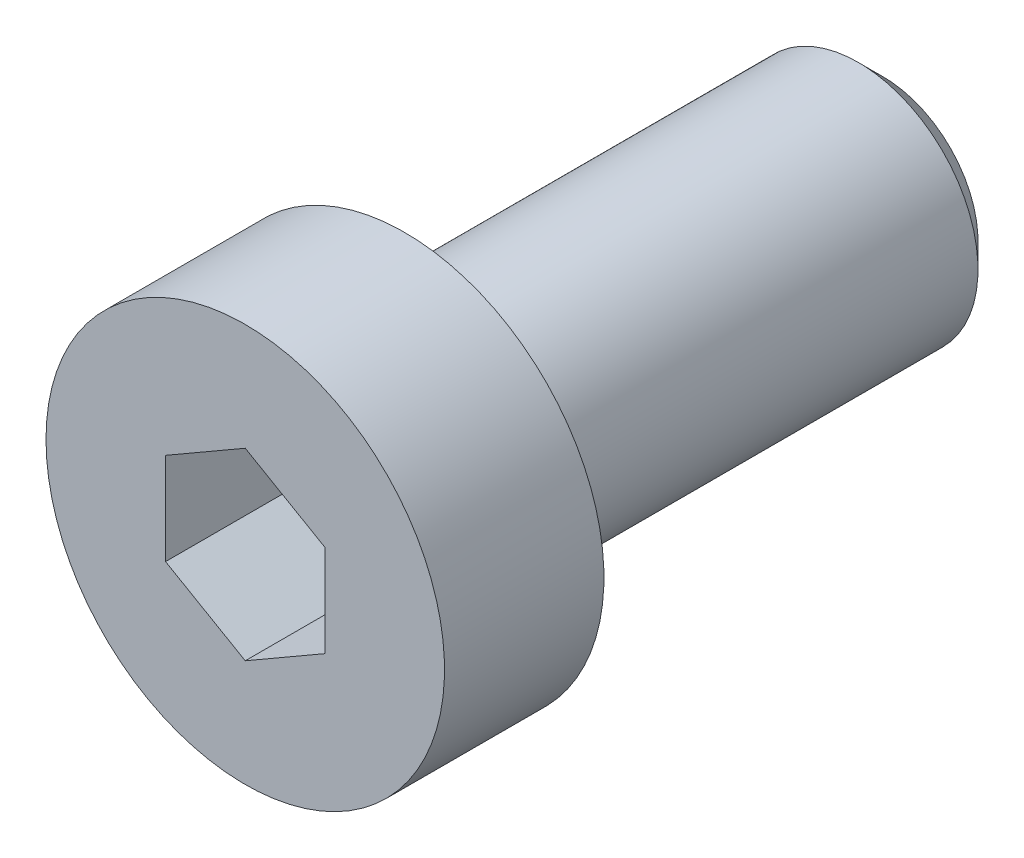
ISO-10303-21;
HEADER;
FILE_DESCRIPTION(('STEP AP214'),'2;1');
FILE_NAME('part.step','',(''),(''),'','','');
FILE_SCHEMA(('AUTOMOTIVE_DESIGN { 1 0 10303 214 1 1 1 1 }'));
ENDSEC;
DATA;
#1=APPLICATION_CONTEXT('core data for automotive mechanical design processes');
#2=APPLICATION_PROTOCOL_DEFINITION('international standard','automotive_design',2000,#1);
#3=PRODUCT_CONTEXT('',#1,'mechanical');
#4=PRODUCT('Part','Part','',(#3));
#5=PRODUCT_RELATED_PRODUCT_CATEGORY('part','',(#4));
#6=PRODUCT_DEFINITION_FORMATION('','',#4);
#7=PRODUCT_DEFINITION_CONTEXT('part definition',#1,'design');
#8=PRODUCT_DEFINITION('design','',#6,#7);
#9=PRODUCT_DEFINITION_SHAPE('','',#8);
#10=(LENGTH_UNIT() NAMED_UNIT(*) SI_UNIT(.MILLI.,.METRE.));
#11=(NAMED_UNIT(*) PLANE_ANGLE_UNIT() SI_UNIT($,.RADIAN.));
#12=(NAMED_UNIT(*) SI_UNIT($,.STERADIAN.) SOLID_ANGLE_UNIT());
#13=UNCERTAINTY_MEASURE_WITH_UNIT(LENGTH_MEASURE(1.E-05),#10,'distance_accuracy_value','');
#14=(GEOMETRIC_REPRESENTATION_CONTEXT(3) GLOBAL_UNCERTAINTY_ASSIGNED_CONTEXT((#13)) GLOBAL_UNIT_ASSIGNED_CONTEXT((#10,
#11,#12)) REPRESENTATION_CONTEXT('',''));
#15=CARTESIAN_POINT('',(0.,0.,0.));
#16=DIRECTION('',(0.,0.,1.));
#17=DIRECTION('',(1.,0.,0.));
#18=AXIS2_PLACEMENT_3D('',#15,#16,#17);
#19=CARTESIAN_POINT('',(0.,0.,-3.4));
#20=DIRECTION('',(0.,0.,1.));
#21=DIRECTION('',(1.,0.,0.));
#22=AXIS2_PLACEMENT_3D('',#19,#20,#21);
#23=PLANE('',#22);
#24=DIRECTION('',(0.,-1.,0.));
#25=VECTOR('',#24,1.);
#26=CARTESIAN_POINT('',(-17.5,22.6547005383793,-3.4));
#27=LINE('',#26,#25);
#28=CARTESIAN_POINT('',(-17.5,22.6547005383793,-3.4));
#29=VERTEX_POINT('',#28);
#30=CARTESIAN_POINT('',(-17.5,21.5,-3.39999999999918));
#31=VERTEX_POINT('',#30);
#32=EDGE_CURVE('E350',#29,#31,#27,.T.);
#33=ORIENTED_EDGE('',*,*,#32,.T.);
#34=CARTESIAN_POINT('',(-15.5,21.5,-3.39999999999918));
#35=DIRECTION('',(0.,0.,-1.));
#36=DIRECTION('',(-1.,0.,0.));
#37=AXIS2_PLACEMENT_3D('',#34,#35,#36);
#38=CIRCLE('',#37,2.00000000000637);
#39=CARTESIAN_POINT('',(-16.5000000000032,23.2320508075744,-3.39999999999918));
#40=VERTEX_POINT('',#39);
#41=EDGE_CURVE('E50',#31,#40,#38,.T.);
#42=ORIENTED_EDGE('',*,*,#41,.T.);
#43=DIRECTION('',(-0.866025403784445,-0.499999999999989,0.));
#44=VECTOR('',#43,1.);
#45=CARTESIAN_POINT('',(-15.5,23.8094010767585,-3.4));
#46=LINE('',#45,#44);
#47=EDGE_CURVE('E337',#40,#29,#46,.T.);
#48=ORIENTED_EDGE('',*,*,#47,.T.);
#49=EDGE_LOOP('',(#33,#42,#48));
#50=FACE_BOUND('',#49,.T.);
#51=ADVANCED_FACE('F35',(#50),#23,.T.);
#52=CARTESIAN_POINT('',(-15.5,23.8094010767585,-3.4));
#53=VERTEX_POINT('',#52);
#54=EDGE_CURVE('E367',#53,#40,#46,.T.);
#55=ORIENTED_EDGE('',*,*,#54,.T.);
#56=CARTESIAN_POINT('',(-14.4999999999968,23.2320508075744,-3.39999999999918));
#57=VERTEX_POINT('',#56);
#58=EDGE_CURVE('E200',#40,#57,#38,.T.);
#59=ORIENTED_EDGE('',*,*,#58,.T.);
#60=DIRECTION('',(-0.866025403784446,0.499999999999988,0.));
#61=VECTOR('',#60,1.);
#62=CARTESIAN_POINT('',(-13.5,22.6547005383793,-3.4));
#63=LINE('',#62,#61);
#64=EDGE_CURVE('E312',#57,#53,#63,.T.);
#65=ORIENTED_EDGE('',*,*,#64,.T.);
#66=EDGE_LOOP('',(#55,#59,#65));
#67=FACE_BOUND('',#66,.T.);
#68=ADVANCED_FACE('F123',(#67),#23,.T.);
#69=CARTESIAN_POINT('',(-13.5,22.6547005383793,-3.4));
#70=VERTEX_POINT('',#69);
#71=EDGE_CURVE('E315',#70,#57,#63,.T.);
#72=ORIENTED_EDGE('',*,*,#71,.T.);
#73=CARTESIAN_POINT('',(-13.4999999999936,21.5,-3.39999999999918));
#74=VERTEX_POINT('',#73);
#75=EDGE_CURVE('E371',#57,#74,#38,.T.);
#76=ORIENTED_EDGE('',*,*,#75,.T.);
#77=DIRECTION('',(0.,1.,0.));
#78=VECTOR('',#77,1.);
#79=CARTESIAN_POINT('',(-13.5,20.3452994616207,-3.4));
#80=LINE('',#79,#78);
#81=EDGE_CURVE('E313',#74,#70,#80,.T.);
#82=ORIENTED_EDGE('',*,*,#81,.T.);
#83=EDGE_LOOP('',(#72,#76,#82));
#84=FACE_BOUND('',#83,.T.);
#85=ADVANCED_FACE('F128',(#84),#23,.T.);
#86=CARTESIAN_POINT('',(-13.5,20.3452994616207,-3.4));
#87=VERTEX_POINT('',#86);
#88=EDGE_CURVE('E306',#87,#74,#80,.T.);
#89=ORIENTED_EDGE('',*,*,#88,.T.);
#90=CARTESIAN_POINT('',(-14.4999999999968,19.7679491924256,-3.39999999999918));
#91=VERTEX_POINT('',#90);
#92=EDGE_CURVE('E307',#74,#91,#38,.T.);
#93=ORIENTED_EDGE('',*,*,#92,.T.);
#94=DIRECTION('',(0.866025403784444,0.49999999999999,0.));
#95=VECTOR('',#94,1.);
#96=CARTESIAN_POINT('',(-15.5,19.1905989232415,-3.4));
#97=LINE('',#96,#95);
#98=EDGE_CURVE('E309',#91,#87,#97,.T.);
#99=ORIENTED_EDGE('',*,*,#98,.T.);
#100=EDGE_LOOP('',(#89,#93,#99));
#101=FACE_BOUND('',#100,.T.);
#102=ADVANCED_FACE('F176',(#101),#23,.T.);
#103=CARTESIAN_POINT('',(-15.5,19.1905989232415,-3.4));
#104=VERTEX_POINT('',#103);
#105=EDGE_CURVE('E317',#104,#91,#97,.T.);
#106=ORIENTED_EDGE('',*,*,#105,.T.);
#107=CARTESIAN_POINT('',(-16.5000000000032,19.7679491924256,-3.39999999999918));
#108=VERTEX_POINT('',#107);
#109=EDGE_CURVE('E372',#91,#108,#38,.T.);
#110=ORIENTED_EDGE('',*,*,#109,.T.);
#111=DIRECTION('',(0.866025403784446,-0.499999999999987,0.));
#112=VECTOR('',#111,1.);
#113=CARTESIAN_POINT('',(-17.5,20.3452994616207,-3.4));
#114=LINE('',#113,#112);
#115=EDGE_CURVE('E359',#108,#104,#114,.T.);
#116=ORIENTED_EDGE('',*,*,#115,.T.);
#117=EDGE_LOOP('',(#106,#110,#116));
#118=FACE_BOUND('',#117,.T.);
#119=ADVANCED_FACE('F121',(#118),#23,.T.);
#120=CARTESIAN_POINT('',(-15.5,21.5,-0.4));
#121=DIRECTION('',(0.,0.,-1.));
#122=DIRECTION('',(-1.,0.,0.));
#123=AXIS2_PLACEMENT_3D('',#120,#121,#122);
#124=CYLINDRICAL_SURFACE('',#123,5.);
#125=CARTESIAN_POINT('',(-15.5,21.5,-0.4));
#126=DIRECTION('',(0.,0.,-1.));
#127=DIRECTION('',(-1.,0.,0.));
#128=AXIS2_PLACEMENT_3D('',#125,#126,#127);
#129=CIRCLE('',#128,5.);
#130=CARTESIAN_POINT('',(-20.5,21.5,-0.4));
#131=VERTEX_POINT('',#130);
#132=EDGE_CURVE('E181',#131,#131,#129,.T.);
#133=ORIENTED_EDGE('',*,*,#132,.T.);
#134=EDGE_LOOP('',(#133));
#135=FACE_BOUND('',#134,.T.);
#136=CARTESIAN_POINT('',(-15.5,21.5,-4.4));
#137=DIRECTION('',(0.,0.,-1.));
#138=DIRECTION('',(-1.,0.,0.));
#139=AXIS2_PLACEMENT_3D('',#136,#137,#138);
#140=CIRCLE('',#139,5.);
#141=CARTESIAN_POINT('',(-20.5,21.5,-4.4));
#142=VERTEX_POINT('',#141);
#143=EDGE_CURVE('E184',#142,#142,#140,.T.);
#144=ORIENTED_EDGE('',*,*,#143,.F.);
#145=EDGE_LOOP('',(#144));
#146=FACE_BOUND('',#145,.T.);
#147=ADVANCED_FACE('F169',(#135,#146),#124,.T.);
#148=CARTESIAN_POINT('',(-10.5,21.5,-0.4));
#149=DIRECTION('',(0.,0.,1.));
#150=DIRECTION('',(1.,0.,0.));
#151=AXIS2_PLACEMENT_3D('',#148,#149,#150);
#152=PLANE('',#151);
#153=DIRECTION('',(-0.866025403784445,-0.499999999999989,0.));
#154=VECTOR('',#153,1.);
#155=CARTESIAN_POINT('',(-15.5,23.8094010767585,-0.4));
#156=LINE('',#155,#154);
#157=CARTESIAN_POINT('',(-15.5,23.8094010767585,-0.4));
#158=VERTEX_POINT('',#157);
#159=CARTESIAN_POINT('',(-17.5,22.6547005383793,-0.4));
#160=VERTEX_POINT('',#159);
#161=EDGE_CURVE('E58',#158,#160,#156,.T.);
#162=ORIENTED_EDGE('',*,*,#161,.F.);
#163=DIRECTION('',(-0.866025403784446,0.499999999999988,0.));
#164=VECTOR('',#163,1.);
#165=CARTESIAN_POINT('',(-13.5,22.6547005383793,-0.4));
#166=LINE('',#165,#164);
#167=CARTESIAN_POINT('',(-13.5,22.6547005383793,-0.4));
#168=VERTEX_POINT('',#167);
#169=EDGE_CURVE('E335',#168,#158,#166,.T.);
#170=ORIENTED_EDGE('',*,*,#169,.F.);
#171=DIRECTION('',(0.,1.,0.));
#172=VECTOR('',#171,1.);
#173=CARTESIAN_POINT('',(-13.5,20.3452994616207,-0.4));
#174=LINE('',#173,#172);
#175=CARTESIAN_POINT('',(-13.5,20.3452994616207,-0.4));
#176=VERTEX_POINT('',#175);
#177=EDGE_CURVE('E332',#176,#168,#174,.T.);
#178=ORIENTED_EDGE('',*,*,#177,.F.);
#179=DIRECTION('',(0.866025403784444,0.49999999999999,0.));
#180=VECTOR('',#179,1.);
#181=CARTESIAN_POINT('',(-15.5,19.1905989232415,-0.4));
#182=LINE('',#181,#180);
#183=CARTESIAN_POINT('',(-15.5,19.1905989232415,-0.4));
#184=VERTEX_POINT('',#183);
#185=EDGE_CURVE('E329',#184,#176,#182,.T.);
#186=ORIENTED_EDGE('',*,*,#185,.F.);
#187=DIRECTION('',(0.866025403784446,-0.499999999999987,0.));
#188=VECTOR('',#187,1.);
#189=CARTESIAN_POINT('',(-17.5,20.3452994616207,-0.4));
#190=LINE('',#189,#188);
#191=CARTESIAN_POINT('',(-17.5,20.3452994616207,-0.4));
#192=VERTEX_POINT('',#191);
#193=EDGE_CURVE('E326',#192,#184,#190,.T.);
#194=ORIENTED_EDGE('',*,*,#193,.F.);
#195=DIRECTION('',(0.,-1.,0.));
#196=VECTOR('',#195,1.);
#197=CARTESIAN_POINT('',(-17.5,22.6547005383793,-0.4));
#198=LINE('',#197,#196);
#199=EDGE_CURVE('E323',#160,#192,#198,.T.);
#200=ORIENTED_EDGE('',*,*,#199,.F.);
#201=EDGE_LOOP('',(#162,#170,#178,#186,#194,#200));
#202=FACE_BOUND('',#201,.T.);
#203=ORIENTED_EDGE('',*,*,#132,.F.);
#204=EDGE_LOOP('',(#203));
#205=FACE_BOUND('',#204,.T.);
#206=ADVANCED_FACE('F165',(#202,#205),#152,.T.);
#207=CARTESIAN_POINT('',(-15.5,21.5,-4.4));
#208=DIRECTION('',(0.,0.,-1.));
#209=DIRECTION('',(-1.,0.,0.));
#210=AXIS2_PLACEMENT_3D('',#207,#208,#209);
#211=PLANE('',#210);
#212=CARTESIAN_POINT('',(-15.5,21.5,-4.4));
#213=DIRECTION('',(0.,0.,-1.));
#214=DIRECTION('',(-1.,0.,0.));
#215=AXIS2_PLACEMENT_3D('',#212,#213,#214);
#216=CIRCLE('',#215,3.2);
#217=CARTESIAN_POINT('',(-18.7,21.5,-4.4));
#218=VERTEX_POINT('',#217);
#219=EDGE_CURVE('E11',#218,#218,#216,.F.);
#220=ORIENTED_EDGE('',*,*,#219,.T.);
#221=EDGE_LOOP('',(#220));
#222=FACE_BOUND('',#221,.T.);
#223=ORIENTED_EDGE('',*,*,#143,.T.);
#224=EDGE_LOOP('',(#223));
#225=FACE_BOUND('',#224,.T.);
#226=ADVANCED_FACE('F161',(#222,#225),#211,.T.);
#227=CARTESIAN_POINT('',(-15.5,21.5,-16.4));
#228=DIRECTION('',(0.,0.,1.));
#229=DIRECTION('',(1.,0.,0.));
#230=AXIS2_PLACEMENT_3D('',#227,#228,#229);
#231=CYLINDRICAL_SURFACE('',#230,3.);
#232=CARTESIAN_POINT('',(-15.5,21.5,-4.6));
#233=DIRECTION('',(0.,0.,-1.));
#234=DIRECTION('',(-1.,0.,0.));
#235=AXIS2_PLACEMENT_3D('',#232,#233,#234);
#236=CIRCLE('',#235,3.);
#237=CARTESIAN_POINT('',(-18.5,21.5,-4.6));
#238=VERTEX_POINT('',#237);
#239=EDGE_CURVE('E43',#238,#238,#236,.T.);
#240=ORIENTED_EDGE('',*,*,#239,.T.);
#241=EDGE_LOOP('',(#240));
#242=FACE_BOUND('',#241,.T.);
#243=CARTESIAN_POINT('',(-15.5,21.5,-15.7865000000105));
#244=DIRECTION('',(0.,0.,-1.));
#245=DIRECTION('',(-1.,0.,0.));
#246=AXIS2_PLACEMENT_3D('',#243,#244,#245);
#247=CIRCLE('',#246,3.);
#248=CARTESIAN_POINT('',(-18.5,21.5,-15.7865000000105));
#249=VERTEX_POINT('',#248);
#250=EDGE_CURVE('E199',#249,#249,#247,.F.);
#251=ORIENTED_EDGE('',*,*,#250,.T.);
#252=EDGE_LOOP('',(#251));
#253=FACE_BOUND('',#252,.T.);
#254=ADVANCED_FACE('F157',(#242,#253),#231,.T.);
#255=CARTESIAN_POINT('',(-15.5,21.5,-16.4));
#256=DIRECTION('',(0.,0.,-1.));
#257=DIRECTION('',(-1.,0.,0.));
#258=AXIS2_PLACEMENT_3D('',#255,#256,#257);
#259=PLANE('',#258);
#260=CARTESIAN_POINT('',(-15.5,21.5,-16.4));
#261=DIRECTION('',(0.,0.,-1.));
#262=DIRECTION('',(-1.,0.,0.));
#263=AXIS2_PLACEMENT_3D('',#260,#261,#262);
#264=CIRCLE('',#263,2.38650000001045);
#265=CARTESIAN_POINT('',(-17.8865000000105,21.5,-16.4));
#266=VERTEX_POINT('',#265);
#267=EDGE_CURVE('E196',#266,#266,#264,.T.);
#268=ORIENTED_EDGE('',*,*,#267,.T.);
#269=EDGE_LOOP('',(#268));
#270=FACE_BOUND('',#269,.T.);
#271=ADVANCED_FACE('F154',(#270),#259,.T.);
#272=CARTESIAN_POINT('',(-15.5,23.8094010767585,-3.4));
#273=DIRECTION('',(-0.499999999999989,0.866025403784445,0.));
#274=DIRECTION('',(-0.866025403784445,-0.499999999999989,0.));
#275=AXIS2_PLACEMENT_3D('',#272,#273,#274);
#276=PLANE('',#275);
#277=ORIENTED_EDGE('',*,*,#161,.T.);
#278=DIRECTION('',(0.,0.,1.));
#279=VECTOR('',#278,1.);
#280=CARTESIAN_POINT('',(-17.5,22.6547005383793,-3.4));
#281=LINE('',#280,#279);
#282=EDGE_CURVE('E193',#29,#160,#281,.T.);
#283=ORIENTED_EDGE('',*,*,#282,.F.);
#284=ORIENTED_EDGE('',*,*,#47,.F.);
#285=ORIENTED_EDGE('',*,*,#54,.F.);
#286=DIRECTION('',(0.,0.,1.));
#287=VECTOR('',#286,1.);
#288=CARTESIAN_POINT('',(-15.5,23.8094010767585,-3.4));
#289=LINE('',#288,#287);
#290=EDGE_CURVE('E186',#53,#158,#289,.T.);
#291=ORIENTED_EDGE('',*,*,#290,.T.);
#292=EDGE_LOOP('',(#277,#283,#284,#285,#291));
#293=FACE_BOUND('',#292,.T.);
#294=ADVANCED_FACE('F136',(#293),#276,.F.);
#295=CARTESIAN_POINT('',(-13.5,22.6547005383793,-3.4));
#296=DIRECTION('',(0.499999999999988,0.866025403784446,0.));
#297=DIRECTION('',(-0.866025403784446,0.499999999999988,0.));
#298=AXIS2_PLACEMENT_3D('',#295,#296,#297);
#299=PLANE('',#298);
#300=ORIENTED_EDGE('',*,*,#169,.T.);
#301=ORIENTED_EDGE('',*,*,#290,.F.);
#302=ORIENTED_EDGE('',*,*,#64,.F.);
#303=ORIENTED_EDGE('',*,*,#71,.F.);
#304=DIRECTION('',(0.,0.,1.));
#305=VECTOR('',#304,1.);
#306=CARTESIAN_POINT('',(-13.5,22.6547005383793,-3.4));
#307=LINE('',#306,#305);
#308=EDGE_CURVE('E190',#70,#168,#307,.T.);
#309=ORIENTED_EDGE('',*,*,#308,.T.);
#310=EDGE_LOOP('',(#300,#301,#302,#303,#309));
#311=FACE_BOUND('',#310,.T.);
#312=ADVANCED_FACE('F132',(#311),#299,.F.);
#313=CARTESIAN_POINT('',(-13.5,20.3452994616207,-3.4));
#314=DIRECTION('',(1.,0.,0.));
#315=DIRECTION('',(0.,1.,0.));
#316=AXIS2_PLACEMENT_3D('',#313,#314,#315);
#317=PLANE('',#316);
#318=ORIENTED_EDGE('',*,*,#177,.T.);
#319=ORIENTED_EDGE('',*,*,#308,.F.);
#320=ORIENTED_EDGE('',*,*,#81,.F.);
#321=ORIENTED_EDGE('',*,*,#88,.F.);
#322=DIRECTION('',(0.,0.,1.));
#323=VECTOR('',#322,1.);
#324=CARTESIAN_POINT('',(-13.5,20.3452994616207,-3.4));
#325=LINE('',#324,#323);
#326=EDGE_CURVE('E340',#87,#176,#325,.T.);
#327=ORIENTED_EDGE('',*,*,#326,.T.);
#328=EDGE_LOOP('',(#318,#319,#320,#321,#327));
#329=FACE_BOUND('',#328,.T.);
#330=ADVANCED_FACE('F135',(#329),#317,.F.);
#331=CARTESIAN_POINT('',(-15.5,19.1905989232415,-3.4));
#332=DIRECTION('',(0.49999999999999,-0.866025403784444,0.));
#333=DIRECTION('',(0.866025403784444,0.49999999999999,0.));
#334=AXIS2_PLACEMENT_3D('',#331,#332,#333);
#335=PLANE('',#334);
#336=ORIENTED_EDGE('',*,*,#185,.T.);
#337=ORIENTED_EDGE('',*,*,#326,.F.);
#338=ORIENTED_EDGE('',*,*,#98,.F.);
#339=ORIENTED_EDGE('',*,*,#105,.F.);
#340=DIRECTION('',(0.,0.,1.));
#341=VECTOR('',#340,1.);
#342=CARTESIAN_POINT('',(-15.5,19.1905989232415,-3.4));
#343=LINE('',#342,#341);
#344=EDGE_CURVE('E342',#104,#184,#343,.T.);
#345=ORIENTED_EDGE('',*,*,#344,.T.);
#346=EDGE_LOOP('',(#336,#337,#338,#339,#345));
#347=FACE_BOUND('',#346,.T.);
#348=ADVANCED_FACE('F140',(#347),#335,.F.);
#349=CARTESIAN_POINT('',(-17.5,20.3452994616207,-3.4));
#350=DIRECTION('',(-0.499999999999988,-0.866025403784446,0.));
#351=DIRECTION('',(0.866025403784446,-0.499999999999988,0.));
#352=AXIS2_PLACEMENT_3D('',#349,#350,#351);
#353=PLANE('',#352);
#354=ORIENTED_EDGE('',*,*,#193,.T.);
#355=ORIENTED_EDGE('',*,*,#344,.F.);
#356=ORIENTED_EDGE('',*,*,#115,.F.);
#357=CARTESIAN_POINT('',(-17.5,20.3452994616207,-3.4));
#358=VERTEX_POINT('',#357);
#359=EDGE_CURVE('E363',#358,#108,#114,.T.);
#360=ORIENTED_EDGE('',*,*,#359,.F.);
#361=DIRECTION('',(0.,0.,1.));
#362=VECTOR('',#361,1.);
#363=CARTESIAN_POINT('',(-17.5,20.3452994616207,-3.4));
#364=LINE('',#363,#362);
#365=EDGE_CURVE('E343',#358,#192,#364,.T.);
#366=ORIENTED_EDGE('',*,*,#365,.T.);
#367=EDGE_LOOP('',(#354,#355,#356,#360,#366));
#368=FACE_BOUND('',#367,.T.);
#369=ADVANCED_FACE('F144',(#368),#353,.F.);
#370=CARTESIAN_POINT('',(-17.5,22.6547005383793,-3.4));
#371=DIRECTION('',(-1.,0.,0.));
#372=DIRECTION('',(0.,-1.,0.));
#373=AXIS2_PLACEMENT_3D('',#370,#371,#372);
#374=PLANE('',#373);
#375=ORIENTED_EDGE('',*,*,#199,.T.);
#376=ORIENTED_EDGE('',*,*,#365,.F.);
#377=EDGE_CURVE('E366',#31,#358,#27,.T.);
#378=ORIENTED_EDGE('',*,*,#377,.F.);
#379=ORIENTED_EDGE('',*,*,#32,.F.);
#380=ORIENTED_EDGE('',*,*,#282,.T.);
#381=EDGE_LOOP('',(#375,#376,#378,#379,#380));
#382=FACE_BOUND('',#381,.T.);
#383=ADVANCED_FACE('F118',(#382),#374,.F.);
#384=ORIENTED_EDGE('',*,*,#359,.T.);
#385=EDGE_CURVE('E188',#108,#31,#38,.T.);
#386=ORIENTED_EDGE('',*,*,#385,.T.);
#387=ORIENTED_EDGE('',*,*,#377,.T.);
#388=EDGE_LOOP('',(#384,#386,#387));
#389=FACE_BOUND('',#388,.T.);
#390=ADVANCED_FACE('F111',(#389),#23,.T.);
#391=CARTESIAN_POINT('',(-15.5,21.5,-4.12794046852243));
#392=DIRECTION('',(0.,0.,1.));
#393=DIRECTION('',(1.,0.,0.));
#394=AXIS2_PLACEMENT_3D('',#391,#392,#393);
#395=CONICAL_SURFACE('',#394,0.,1.2217304764011);
#396=ORIENTED_EDGE('',*,*,#41,.F.);
#397=ORIENTED_EDGE('',*,*,#385,.F.);
#398=ORIENTED_EDGE('',*,*,#109,.F.);
#399=ORIENTED_EDGE('',*,*,#92,.F.);
#400=ORIENTED_EDGE('',*,*,#75,.F.);
#401=ORIENTED_EDGE('',*,*,#58,.F.);
#402=EDGE_LOOP('',(#396,#397,#398,#399,#400,#401));
#403=FACE_BOUND('',#402,.T.);
#404=CARTESIAN_POINT('',(-15.5,21.5,-4.12794046852243));
#405=VERTEX_POINT('',#404);
#406=VERTEX_LOOP('',#405);
#407=FACE_BOUND('',#406,.T.);
#408=ADVANCED_FACE('F108',(#403,#407),#395,.F.);
#409=CARTESIAN_POINT('',(-15.5,21.5,-16.4));
#410=DIRECTION('',(0.,0.,1.));
#411=DIRECTION('',(1.,0.,0.));
#412=AXIS2_PLACEMENT_3D('',#409,#410,#411);
#413=CONICAL_SURFACE('',#412,2.38650000001045,0.785398163397448);
#414=ORIENTED_EDGE('',*,*,#250,.F.);
#415=EDGE_LOOP('',(#414));
#416=FACE_BOUND('',#415,.T.);
#417=ORIENTED_EDGE('',*,*,#267,.F.);
#418=EDGE_LOOP('',(#417));
#419=FACE_BOUND('',#418,.T.);
#420=ADVANCED_FACE('F110',(#416,#419),#413,.T.);
#421=CARTESIAN_POINT('',(-15.5,21.5,-4.6));
#422=DIRECTION('',(0.,0.,-1.));
#423=DIRECTION('',(-1.,0.,0.));
#424=AXIS2_PLACEMENT_3D('',#421,#422,#423);
#425=TOROIDAL_SURFACE('',#424,3.2,0.200000000000001);
#426=ORIENTED_EDGE('',*,*,#219,.F.);
#427=EDGE_LOOP('',(#426));
#428=FACE_BOUND('',#427,.T.);
#429=ORIENTED_EDGE('',*,*,#239,.F.);
#430=EDGE_LOOP('',(#429));
#431=FACE_BOUND('',#430,.T.);
#432=ADVANCED_FACE('F37',(#428,#431),#425,.F.);
#433=CLOSED_SHELL('',(#51,#68,#85,#102,#119,#147,#206,#226,#254,#271,#294,#312,#330,#348,#369,
#383,#390,#408,#420,#432));
#434=MANIFOLD_SOLID_BREP('B2',#433);
#435=ADVANCED_BREP_SHAPE_REPRESENTATION('',(#18,#434),#14);
#436=SHAPE_DEFINITION_REPRESENTATION(#9,#435);
ENDSEC;
END-ISO-10303-21;
